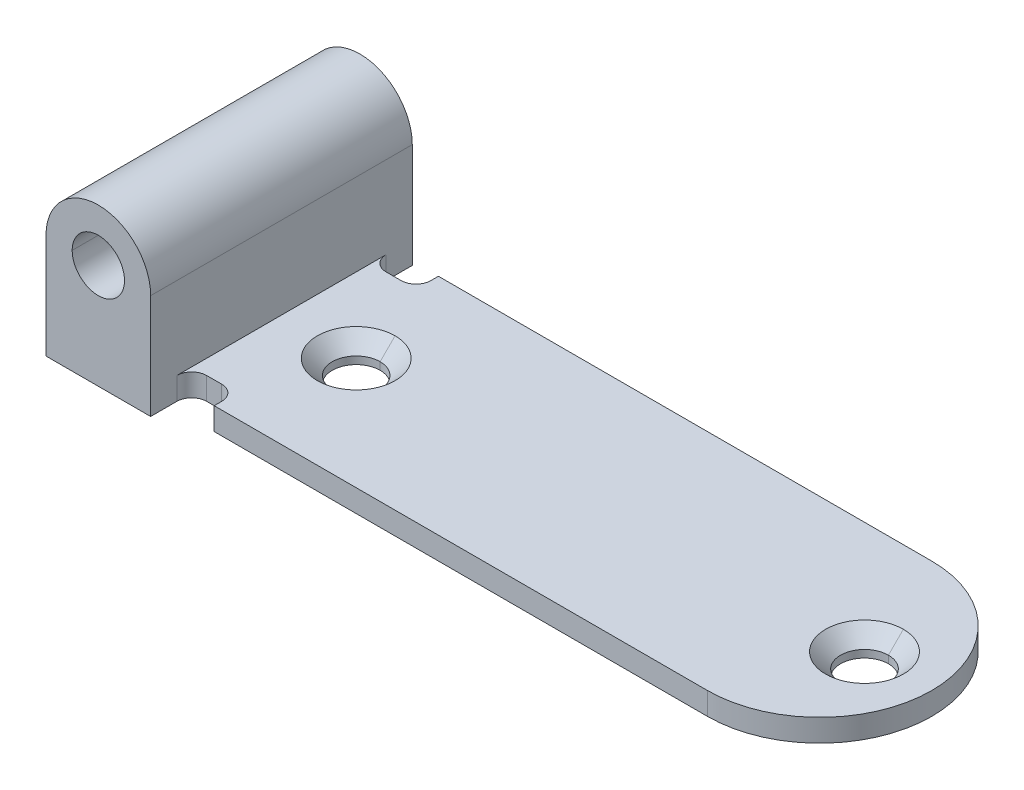
ISO-10303-21;
HEADER;
FILE_DESCRIPTION(('STEP AP214'),'2;1');
FILE_NAME('part.step','',(''),(''),'','','');
FILE_SCHEMA(('AUTOMOTIVE_DESIGN { 1 0 10303 214 1 1 1 1 }'));
ENDSEC;
DATA;
#1=APPLICATION_CONTEXT('core data for automotive mechanical design processes');
#2=APPLICATION_PROTOCOL_DEFINITION('international standard','automotive_design',2000,#1);
#3=PRODUCT_CONTEXT('',#1,'mechanical');
#4=PRODUCT('Part','Part','',(#3));
#5=PRODUCT_RELATED_PRODUCT_CATEGORY('part','',(#4));
#6=PRODUCT_DEFINITION_FORMATION('','',#4);
#7=PRODUCT_DEFINITION_CONTEXT('part definition',#1,'design');
#8=PRODUCT_DEFINITION('design','',#6,#7);
#9=PRODUCT_DEFINITION_SHAPE('','',#8);
#10=(LENGTH_UNIT() NAMED_UNIT(*) SI_UNIT(.MILLI.,.METRE.));
#11=(NAMED_UNIT(*) PLANE_ANGLE_UNIT() SI_UNIT($,.RADIAN.));
#12=(NAMED_UNIT(*) SI_UNIT($,.STERADIAN.) SOLID_ANGLE_UNIT());
#13=UNCERTAINTY_MEASURE_WITH_UNIT(LENGTH_MEASURE(1.E-05),#10,'distance_accuracy_value','');
#14=(GEOMETRIC_REPRESENTATION_CONTEXT(3) GLOBAL_UNCERTAINTY_ASSIGNED_CONTEXT((#13)) GLOBAL_UNIT_ASSIGNED_CONTEXT((#10,
#11,#12)) REPRESENTATION_CONTEXT('',''));
#15=CARTESIAN_POINT('',(0.,0.,0.));
#16=DIRECTION('',(0.,0.,1.));
#17=DIRECTION('',(1.,0.,0.));
#18=AXIS2_PLACEMENT_3D('',#15,#16,#17);
#19=CARTESIAN_POINT('',(51.,1.5,8.75));
#20=DIRECTION('',(0.,-1.,0.));
#21=DIRECTION('',(0.,0.,-1.));
#22=AXIS2_PLACEMENT_3D('',#19,#20,#21);
#23=PLANE('',#22);
#24=CARTESIAN_POINT('',(46.,1.5,0.));
#25=DIRECTION('',(0.,-1.,0.));
#26=DIRECTION('',(0.,0.,-1.));
#27=AXIS2_PLACEMENT_3D('',#24,#25,#26);
#28=CIRCLE('',#27,2.6);
#29=CARTESIAN_POINT('',(46.,1.5,-2.6));
#30=VERTEX_POINT('',#29);
#31=CARTESIAN_POINT('',(46.,1.5,2.6));
#32=VERTEX_POINT('',#31);
#33=EDGE_CURVE('E11',#30,#32,#28,.T.);
#34=ORIENTED_EDGE('',*,*,#33,.T.);
#35=CARTESIAN_POINT('',(46.,1.5,0.));
#36=DIRECTION('',(0.,-1.,0.));
#37=DIRECTION('',(0.,0.,-1.));
#38=AXIS2_PLACEMENT_3D('',#35,#36,#37);
#39=CIRCLE('',#38,2.6);
#40=EDGE_CURVE('E26',#32,#30,#39,.T.);
#41=ORIENTED_EDGE('',*,*,#40,.T.);
#42=EDGE_LOOP('',(#34,#41));
#43=FACE_BOUND('',#42,.T.);
#44=CARTESIAN_POINT('',(12.,1.5,0.));
#45=DIRECTION('',(0.,-1.,0.));
#46=DIRECTION('',(0.,0.,-1.));
#47=AXIS2_PLACEMENT_3D('',#44,#45,#46);
#48=CIRCLE('',#47,2.6);
#49=CARTESIAN_POINT('',(12.,1.5,-2.6));
#50=VERTEX_POINT('',#49);
#51=CARTESIAN_POINT('',(12.,1.5,2.6));
#52=VERTEX_POINT('',#51);
#53=EDGE_CURVE('E639',#50,#52,#48,.T.);
#54=ORIENTED_EDGE('',*,*,#53,.T.);
#55=CARTESIAN_POINT('',(12.,1.5,0.));
#56=DIRECTION('',(0.,-1.,0.));
#57=DIRECTION('',(0.,0.,-1.));
#58=AXIS2_PLACEMENT_3D('',#55,#56,#57);
#59=CIRCLE('',#58,2.6);
#60=EDGE_CURVE('E634',#52,#50,#59,.T.);
#61=ORIENTED_EDGE('',*,*,#60,.T.);
#62=EDGE_LOOP('',(#54,#61));
#63=FACE_BOUND('',#62,.T.);
#64=CARTESIAN_POINT('',(8.00000000000016,1.5,-7.00000000000016));
#65=DIRECTION('',(0.,1.,0.));
#66=DIRECTION('',(0.,0.,-1.));
#67=AXIS2_PLACEMENT_3D('',#64,#65,#66);
#68=CIRCLE('',#67,1.00000000000016);
#69=CARTESIAN_POINT('',(7.,1.5,-7.));
#70=VERTEX_POINT('',#69);
#71=CARTESIAN_POINT('',(8.,1.5,-6.));
#72=VERTEX_POINT('',#71);
#73=EDGE_CURVE('E628',#70,#72,#68,.T.);
#74=ORIENTED_EDGE('',*,*,#73,.F.);
#75=DIRECTION('',(0.,0.,-1.));
#76=VECTOR('',#75,1.);
#77=CARTESIAN_POINT('',(7.,1.5,8.75));
#78=LINE('',#77,#76);
#79=CARTESIAN_POINT('',(7.,1.5,7.));
#80=VERTEX_POINT('',#79);
#81=EDGE_CURVE('E622',#80,#70,#78,.T.);
#82=ORIENTED_EDGE('',*,*,#81,.F.);
#83=CARTESIAN_POINT('',(8.00000000000016,1.5,7.00000000000016));
#84=DIRECTION('',(0.,1.,0.));
#85=DIRECTION('',(0.,0.,-1.));
#86=AXIS2_PLACEMENT_3D('',#83,#84,#85);
#87=CIRCLE('',#86,1.00000000000016);
#88=CARTESIAN_POINT('',(8.,1.5,6.));
#89=VERTEX_POINT('',#88);
#90=EDGE_CURVE('E616',#89,#80,#87,.T.);
#91=ORIENTED_EDGE('',*,*,#90,.F.);
#92=DIRECTION('',(1.,0.,0.));
#93=VECTOR('',#92,1.);
#94=CARTESIAN_POINT('',(51.,1.5,6.));
#95=LINE('',#94,#93);
#96=CARTESIAN_POINT('',(9.,1.5,6.));
#97=VERTEX_POINT('',#96);
#98=EDGE_CURVE('E611',#89,#97,#95,.T.);
#99=ORIENTED_EDGE('',*,*,#98,.T.);
#100=CARTESIAN_POINT('',(9.,1.5,7.));
#101=DIRECTION('',(0.,1.,0.));
#102=DIRECTION('',(0.,0.,-1.));
#103=AXIS2_PLACEMENT_3D('',#100,#101,#102);
#104=CIRCLE('',#103,1.);
#105=CARTESIAN_POINT('',(10.,1.5,7.));
#106=VERTEX_POINT('',#105);
#107=EDGE_CURVE('E605',#106,#97,#104,.T.);
#108=ORIENTED_EDGE('',*,*,#107,.F.);
#109=DIRECTION('',(0.,0.,1.));
#110=VECTOR('',#109,1.);
#111=CARTESIAN_POINT('',(10.,1.5,8.75));
#112=LINE('',#111,#110);
#113=CARTESIAN_POINT('',(10.,1.5,7.5));
#114=VERTEX_POINT('',#113);
#115=EDGE_CURVE('E600',#106,#114,#112,.T.);
#116=ORIENTED_EDGE('',*,*,#115,.T.);
#117=DIRECTION('',(1.,0.,0.));
#118=VECTOR('',#117,1.);
#119=CARTESIAN_POINT('',(51.,1.5,7.5));
#120=LINE('',#119,#118);
#121=CARTESIAN_POINT('',(43.,1.5,7.5));
#122=VERTEX_POINT('',#121);
#123=EDGE_CURVE('E595',#114,#122,#120,.T.);
#124=ORIENTED_EDGE('',*,*,#123,.T.);
#125=CARTESIAN_POINT('',(43.,1.5,0.));
#126=DIRECTION('',(0.,1.,0.));
#127=DIRECTION('',(0.,0.,-1.));
#128=AXIS2_PLACEMENT_3D('',#125,#126,#127);
#129=CIRCLE('',#128,7.5);
#130=CARTESIAN_POINT('',(43.,1.5,-7.5));
#131=VERTEX_POINT('',#130);
#132=EDGE_CURVE('E590',#122,#131,#129,.T.);
#133=ORIENTED_EDGE('',*,*,#132,.T.);
#134=DIRECTION('',(-1.,0.,0.));
#135=VECTOR('',#134,1.);
#136=CARTESIAN_POINT('',(51.,1.5,-7.5));
#137=LINE('',#136,#135);
#138=CARTESIAN_POINT('',(10.,1.5,-7.5));
#139=VERTEX_POINT('',#138);
#140=EDGE_CURVE('E585',#131,#139,#137,.T.);
#141=ORIENTED_EDGE('',*,*,#140,.T.);
#142=DIRECTION('',(0.,0.,1.));
#143=VECTOR('',#142,1.);
#144=CARTESIAN_POINT('',(10.,1.5,8.75));
#145=LINE('',#144,#143);
#146=CARTESIAN_POINT('',(10.,1.5,-7.));
#147=VERTEX_POINT('',#146);
#148=EDGE_CURVE('E580',#139,#147,#145,.T.);
#149=ORIENTED_EDGE('',*,*,#148,.T.);
#150=CARTESIAN_POINT('',(9.,1.5,-7.));
#151=DIRECTION('',(0.,1.,0.));
#152=DIRECTION('',(0.,0.,-1.));
#153=AXIS2_PLACEMENT_3D('',#150,#151,#152);
#154=CIRCLE('',#153,1.);
#155=CARTESIAN_POINT('',(9.,1.5,-6.));
#156=VERTEX_POINT('',#155);
#157=EDGE_CURVE('E574',#156,#147,#154,.T.);
#158=ORIENTED_EDGE('',*,*,#157,.F.);
#159=DIRECTION('',(-1.,0.,0.));
#160=VECTOR('',#159,1.);
#161=CARTESIAN_POINT('',(51.,1.5,-6.));
#162=LINE('',#161,#160);
#163=EDGE_CURVE('E569',#156,#72,#162,.T.);
#164=ORIENTED_EDGE('',*,*,#163,.T.);
#165=EDGE_LOOP('',(#74,#82,#91,#99,#108,#116,#124,#133,#141,#149,#158,#164));
#166=FACE_BOUND('',#165,.T.);
#167=ADVANCED_FACE('F17',(#43,#63,#166),#23,.F.);
#168=CARTESIAN_POINT('',(9.,18.,-6.));
#169=DIRECTION('',(0.,0.,1.));
#170=DIRECTION('',(1.,0.,0.));
#171=AXIS2_PLACEMENT_3D('',#168,#169,#170);
#172=PLANE('',#171);
#173=DIRECTION('',(0.,-1.,0.));
#174=VECTOR('',#173,1.);
#175=CARTESIAN_POINT('',(9.,18.,-6.));
#176=LINE('',#175,#174);
#177=CARTESIAN_POINT('',(9.,0.,-6.));
#178=VERTEX_POINT('',#177);
#179=EDGE_CURVE('E564',#156,#178,#176,.T.);
#180=ORIENTED_EDGE('',*,*,#179,.T.);
#181=DIRECTION('',(-1.,0.,0.));
#182=VECTOR('',#181,1.);
#183=CARTESIAN_POINT('',(9.,0.,-6.));
#184=LINE('',#183,#182);
#185=CARTESIAN_POINT('',(8.,0.,-6.));
#186=VERTEX_POINT('',#185);
#187=EDGE_CURVE('E559',#178,#186,#184,.T.);
#188=ORIENTED_EDGE('',*,*,#187,.T.);
#189=DIRECTION('',(0.,-1.,0.));
#190=VECTOR('',#189,1.);
#191=CARTESIAN_POINT('',(8.,18.,-6.));
#192=LINE('',#191,#190);
#193=EDGE_CURVE('E553',#72,#186,#192,.T.);
#194=ORIENTED_EDGE('',*,*,#193,.F.);
#195=ORIENTED_EDGE('',*,*,#163,.F.);
#196=EDGE_LOOP('',(#180,#188,#194,#195));
#197=FACE_BOUND('',#196,.T.);
#198=ADVANCED_FACE('F694',(#197),#172,.F.);
#199=CARTESIAN_POINT('',(8.00000000000016,18.,-7.00000000000016));
#200=DIRECTION('',(0.,-1.,0.));
#201=DIRECTION('',(0.707106781186818,0.,-0.707106781186277));
#202=AXIS2_PLACEMENT_3D('',#199,#200,#201);
#203=CYLINDRICAL_SURFACE('',#202,1.00000000000016);
#204=ORIENTED_EDGE('',*,*,#73,.T.);
#205=ORIENTED_EDGE('',*,*,#193,.T.);
#206=CARTESIAN_POINT('',(8.00000000000016,0.,-7.00000000000016));
#207=DIRECTION('',(0.,1.,0.));
#208=DIRECTION('',(1.,0.,0.));
#209=AXIS2_PLACEMENT_3D('',#206,#207,#208);
#210=CIRCLE('',#209,1.00000000000016);
#211=CARTESIAN_POINT('',(7.,0.,-7.));
#212=VERTEX_POINT('',#211);
#213=EDGE_CURVE('E547',#212,#186,#210,.T.);
#214=ORIENTED_EDGE('',*,*,#213,.F.);
#215=DIRECTION('',(0.,-1.,0.));
#216=VECTOR('',#215,1.);
#217=CARTESIAN_POINT('',(7.,18.,-7.));
#218=LINE('',#217,#216);
#219=EDGE_CURVE('E541',#70,#212,#218,.T.);
#220=ORIENTED_EDGE('',*,*,#219,.F.);
#221=EDGE_LOOP('',(#204,#205,#214,#220));
#222=FACE_BOUND('',#221,.T.);
#223=ADVANCED_FACE('F689',(#222),#203,.F.);
#224=CARTESIAN_POINT('',(7.,1.5,8.75));
#225=DIRECTION('',(-1.,0.,0.));
#226=DIRECTION('',(0.,0.,1.));
#227=AXIS2_PLACEMENT_3D('',#224,#225,#226);
#228=PLANE('',#227);
#229=DIRECTION('',(0.,1.,0.));
#230=VECTOR('',#229,1.);
#231=CARTESIAN_POINT('',(7.,1.5,8.75));
#232=LINE('',#231,#230);
#233=CARTESIAN_POINT('',(7.,0.,8.75));
#234=VERTEX_POINT('',#233);
#235=CARTESIAN_POINT('',(7.,7.,8.75));
#236=VERTEX_POINT('',#235);
#237=EDGE_CURVE('E535',#234,#236,#232,.T.);
#238=ORIENTED_EDGE('',*,*,#237,.F.);
#239=DIRECTION('',(0.,0.,-1.));
#240=VECTOR('',#239,1.);
#241=CARTESIAN_POINT('',(7.,0.,8.75));
#242=LINE('',#241,#240);
#243=CARTESIAN_POINT('',(7.,0.,7.));
#244=VERTEX_POINT('',#243);
#245=EDGE_CURVE('E530',#234,#244,#242,.T.);
#246=ORIENTED_EDGE('',*,*,#245,.T.);
#247=DIRECTION('',(0.,-1.,0.));
#248=VECTOR('',#247,1.);
#249=CARTESIAN_POINT('',(7.,18.,7.));
#250=LINE('',#249,#248);
#251=EDGE_CURVE('E524',#80,#244,#250,.T.);
#252=ORIENTED_EDGE('',*,*,#251,.F.);
#253=ORIENTED_EDGE('',*,*,#81,.T.);
#254=ORIENTED_EDGE('',*,*,#219,.T.);
#255=DIRECTION('',(0.,0.,-1.));
#256=VECTOR('',#255,1.);
#257=CARTESIAN_POINT('',(7.,0.,-7.));
#258=LINE('',#257,#256);
#259=CARTESIAN_POINT('',(7.,0.,-8.75));
#260=VERTEX_POINT('',#259);
#261=EDGE_CURVE('E519',#212,#260,#258,.T.);
#262=ORIENTED_EDGE('',*,*,#261,.T.);
#263=DIRECTION('',(0.,1.,0.));
#264=VECTOR('',#263,1.);
#265=CARTESIAN_POINT('',(7.,1.5,-8.75));
#266=LINE('',#265,#264);
#267=CARTESIAN_POINT('',(7.,7.,-8.75));
#268=VERTEX_POINT('',#267);
#269=EDGE_CURVE('E514',#260,#268,#266,.T.);
#270=ORIENTED_EDGE('',*,*,#269,.T.);
#271=DIRECTION('',(0.,0.,-1.));
#272=VECTOR('',#271,1.);
#273=CARTESIAN_POINT('',(7.,7.,8.75));
#274=LINE('',#273,#272);
#275=EDGE_CURVE('E508',#236,#268,#274,.T.);
#276=ORIENTED_EDGE('',*,*,#275,.F.);
#277=EDGE_LOOP('',(#238,#246,#252,#253,#254,#262,#270,#276));
#278=FACE_BOUND('',#277,.T.);
#279=ADVANCED_FACE('F684',(#278),#228,.F.);
#280=CARTESIAN_POINT('',(3.5,7.,8.75));
#281=DIRECTION('',(0.,0.,-1.));
#282=DIRECTION('',(0.,-1.,0.));
#283=AXIS2_PLACEMENT_3D('',#280,#281,#282);
#284=CYLINDRICAL_SURFACE('',#283,3.5);
#285=CARTESIAN_POINT('',(3.5,7.,-8.75));
#286=DIRECTION('',(0.,0.,1.));
#287=DIRECTION('',(1.,0.,0.));
#288=AXIS2_PLACEMENT_3D('',#285,#286,#287);
#289=CIRCLE('',#288,3.5);
#290=CARTESIAN_POINT('',(0.,7.,-8.75));
#291=VERTEX_POINT('',#290);
#292=EDGE_CURVE('E503',#268,#291,#289,.T.);
#293=ORIENTED_EDGE('',*,*,#292,.T.);
#294=DIRECTION('',(0.,0.,-1.));
#295=VECTOR('',#294,1.);
#296=CARTESIAN_POINT('',(0.,7.,8.75));
#297=LINE('',#296,#295);
#298=CARTESIAN_POINT('',(0.,7.,8.75));
#299=VERTEX_POINT('',#298);
#300=EDGE_CURVE('E497',#299,#291,#297,.T.);
#301=ORIENTED_EDGE('',*,*,#300,.F.);
#302=CARTESIAN_POINT('',(3.5,7.,8.75));
#303=DIRECTION('',(0.,0.,1.));
#304=DIRECTION('',(1.,0.,0.));
#305=AXIS2_PLACEMENT_3D('',#302,#303,#304);
#306=CIRCLE('',#305,3.5);
#307=EDGE_CURVE('E491',#236,#299,#306,.T.);
#308=ORIENTED_EDGE('',*,*,#307,.F.);
#309=ORIENTED_EDGE('',*,*,#275,.T.);
#310=EDGE_LOOP('',(#293,#301,#308,#309));
#311=FACE_BOUND('',#310,.T.);
#312=ADVANCED_FACE('F737',(#311),#284,.T.);
#313=CARTESIAN_POINT('',(3.5,7.,8.75));
#314=DIRECTION('',(0.,0.,1.));
#315=DIRECTION('',(1.,0.,0.));
#316=AXIS2_PLACEMENT_3D('',#313,#314,#315);
#317=PLANE('',#316);
#318=DIRECTION('',(1.,0.,0.));
#319=VECTOR('',#318,1.);
#320=CARTESIAN_POINT('',(0.,0.,8.75));
#321=LINE('',#320,#319);
#322=CARTESIAN_POINT('',(0.,0.,8.75));
#323=VERTEX_POINT('',#322);
#324=EDGE_CURVE('E485',#323,#234,#321,.T.);
#325=ORIENTED_EDGE('',*,*,#324,.T.);
#326=ORIENTED_EDGE('',*,*,#237,.T.);
#327=ORIENTED_EDGE('',*,*,#307,.T.);
#328=DIRECTION('',(0.,-1.,0.));
#329=VECTOR('',#328,1.);
#330=CARTESIAN_POINT('',(0.,7.,8.75));
#331=LINE('',#330,#329);
#332=EDGE_CURVE('E480',#299,#323,#331,.T.);
#333=ORIENTED_EDGE('',*,*,#332,.T.);
#334=EDGE_LOOP('',(#325,#326,#327,#333));
#335=FACE_BOUND('',#334,.T.);
#336=CARTESIAN_POINT('',(3.5,7.,8.75));
#337=DIRECTION('',(0.,0.,1.));
#338=DIRECTION('',(1.,0.,0.));
#339=AXIS2_PLACEMENT_3D('',#336,#337,#338);
#340=CIRCLE('',#339,1.75);
#341=CARTESIAN_POINT('',(1.75,7.,8.75));
#342=VERTEX_POINT('',#341);
#343=CARTESIAN_POINT('',(5.25,7.,8.75));
#344=VERTEX_POINT('',#343);
#345=EDGE_CURVE('E474',#342,#344,#340,.T.);
#346=ORIENTED_EDGE('',*,*,#345,.F.);
#347=CARTESIAN_POINT('',(3.5,7.,8.75));
#348=DIRECTION('',(0.,0.,1.));
#349=DIRECTION('',(1.,0.,0.));
#350=AXIS2_PLACEMENT_3D('',#347,#348,#349);
#351=CIRCLE('',#350,1.75);
#352=EDGE_CURVE('E468',#344,#342,#351,.T.);
#353=ORIENTED_EDGE('',*,*,#352,.F.);
#354=EDGE_LOOP('',(#346,#353));
#355=FACE_BOUND('',#354,.T.);
#356=ADVANCED_FACE('F732',(#335,#355),#317,.T.);
#357=CARTESIAN_POINT('',(3.5,7.,8.75));
#358=DIRECTION('',(0.,0.,-1.));
#359=DIRECTION('',(0.,-1.,0.));
#360=AXIS2_PLACEMENT_3D('',#357,#358,#359);
#361=CYLINDRICAL_SURFACE('',#360,1.75);
#362=DIRECTION('',(0.,0.,-1.));
#363=VECTOR('',#362,1.);
#364=CARTESIAN_POINT('',(5.25,7.,8.75));
#365=LINE('',#364,#363);
#366=CARTESIAN_POINT('',(5.25,7.,-8.75));
#367=VERTEX_POINT('',#366);
#368=EDGE_CURVE('E462',#344,#367,#365,.T.);
#369=ORIENTED_EDGE('',*,*,#368,.F.);
#370=ORIENTED_EDGE('',*,*,#352,.T.);
#371=DIRECTION('',(0.,0.,-1.));
#372=VECTOR('',#371,1.);
#373=CARTESIAN_POINT('',(1.75,7.,8.75));
#374=LINE('',#373,#372);
#375=CARTESIAN_POINT('',(1.75,7.,-8.75));
#376=VERTEX_POINT('',#375);
#377=EDGE_CURVE('E457',#342,#376,#374,.T.);
#378=ORIENTED_EDGE('',*,*,#377,.T.);
#379=CARTESIAN_POINT('',(3.5,7.,-8.75));
#380=DIRECTION('',(0.,0.,1.));
#381=DIRECTION('',(1.,0.,0.));
#382=AXIS2_PLACEMENT_3D('',#379,#380,#381);
#383=CIRCLE('',#382,1.75);
#384=EDGE_CURVE('E451',#367,#376,#383,.T.);
#385=ORIENTED_EDGE('',*,*,#384,.F.);
#386=EDGE_LOOP('',(#369,#370,#378,#385));
#387=FACE_BOUND('',#386,.T.);
#388=ADVANCED_FACE('F745',(#387),#361,.F.);
#389=CARTESIAN_POINT('',(3.5,7.,-8.75));
#390=DIRECTION('',(0.,0.,1.));
#391=DIRECTION('',(1.,0.,0.));
#392=AXIS2_PLACEMENT_3D('',#389,#390,#391);
#393=PLANE('',#392);
#394=ORIENTED_EDGE('',*,*,#384,.T.);
#395=CARTESIAN_POINT('',(3.5,7.,-8.75));
#396=DIRECTION('',(0.,0.,1.));
#397=DIRECTION('',(1.,0.,0.));
#398=AXIS2_PLACEMENT_3D('',#395,#396,#397);
#399=CIRCLE('',#398,1.75);
#400=EDGE_CURVE('E445',#376,#367,#399,.T.);
#401=ORIENTED_EDGE('',*,*,#400,.T.);
#402=EDGE_LOOP('',(#394,#401));
#403=FACE_BOUND('',#402,.T.);
#404=ORIENTED_EDGE('',*,*,#269,.F.);
#405=DIRECTION('',(1.,0.,0.));
#406=VECTOR('',#405,1.);
#407=CARTESIAN_POINT('',(0.,0.,-8.75));
#408=LINE('',#407,#406);
#409=CARTESIAN_POINT('',(0.,0.,-8.75));
#410=VERTEX_POINT('',#409);
#411=EDGE_CURVE('E439',#410,#260,#408,.T.);
#412=ORIENTED_EDGE('',*,*,#411,.F.);
#413=DIRECTION('',(0.,-1.,0.));
#414=VECTOR('',#413,1.);
#415=CARTESIAN_POINT('',(0.,7.,-8.75));
#416=LINE('',#415,#414);
#417=EDGE_CURVE('E433',#291,#410,#416,.T.);
#418=ORIENTED_EDGE('',*,*,#417,.F.);
#419=ORIENTED_EDGE('',*,*,#292,.F.);
#420=EDGE_LOOP('',(#404,#412,#418,#419));
#421=FACE_BOUND('',#420,.T.);
#422=ADVANCED_FACE('F682',(#403,#421),#393,.F.);
#423=CARTESIAN_POINT('',(0.,7.,8.75));
#424=DIRECTION('',(1.,0.,0.));
#425=DIRECTION('',(0.,0.,-1.));
#426=AXIS2_PLACEMENT_3D('',#423,#424,#425);
#427=PLANE('',#426);
#428=ORIENTED_EDGE('',*,*,#417,.T.);
#429=DIRECTION('',(0.,0.,-1.));
#430=VECTOR('',#429,1.);
#431=CARTESIAN_POINT('',(0.,0.,8.75));
#432=LINE('',#431,#430);
#433=EDGE_CURVE('E427',#323,#410,#432,.T.);
#434=ORIENTED_EDGE('',*,*,#433,.F.);
#435=ORIENTED_EDGE('',*,*,#332,.F.);
#436=ORIENTED_EDGE('',*,*,#300,.T.);
#437=EDGE_LOOP('',(#428,#434,#435,#436));
#438=FACE_BOUND('',#437,.T.);
#439=ADVANCED_FACE('F672',(#438),#427,.F.);
#440=CARTESIAN_POINT('',(0.,0.,8.75));
#441=DIRECTION('',(0.,1.,0.));
#442=DIRECTION('',(0.,0.,1.));
#443=AXIS2_PLACEMENT_3D('',#440,#441,#442);
#444=PLANE('',#443);
#445=CARTESIAN_POINT('',(46.,0.,0.));
#446=DIRECTION('',(0.,-1.,0.));
#447=DIRECTION('',(0.,0.,-1.));
#448=AXIS2_PLACEMENT_3D('',#445,#446,#447);
#449=CIRCLE('',#448,1.6);
#450=CARTESIAN_POINT('',(46.,0.,1.6));
#451=VERTEX_POINT('',#450);
#452=CARTESIAN_POINT('',(46.,0.,-1.6));
#453=VERTEX_POINT('',#452);
#454=EDGE_CURVE('E242',#451,#453,#449,.T.);
#455=ORIENTED_EDGE('',*,*,#454,.F.);
#456=CARTESIAN_POINT('',(46.,0.,0.));
#457=DIRECTION('',(0.,-1.,0.));
#458=DIRECTION('',(0.,0.,-1.));
#459=AXIS2_PLACEMENT_3D('',#456,#457,#458);
#460=CIRCLE('',#459,1.6);
#461=EDGE_CURVE('E418',#453,#451,#460,.T.);
#462=ORIENTED_EDGE('',*,*,#461,.F.);
#463=EDGE_LOOP('',(#455,#462));
#464=FACE_BOUND('',#463,.T.);
#465=CARTESIAN_POINT('',(12.,0.,0.));
#466=DIRECTION('',(0.,-1.,0.));
#467=DIRECTION('',(0.,0.,-1.));
#468=AXIS2_PLACEMENT_3D('',#465,#466,#467);
#469=CIRCLE('',#468,1.6);
#470=CARTESIAN_POINT('',(12.,0.,1.6));
#471=VERTEX_POINT('',#470);
#472=CARTESIAN_POINT('',(12.,0.,-1.6));
#473=VERTEX_POINT('',#472);
#474=EDGE_CURVE('E412',#471,#473,#469,.T.);
#475=ORIENTED_EDGE('',*,*,#474,.F.);
#476=CARTESIAN_POINT('',(12.,0.,0.));
#477=DIRECTION('',(0.,-1.,0.));
#478=DIRECTION('',(0.,0.,-1.));
#479=AXIS2_PLACEMENT_3D('',#476,#477,#478);
#480=CIRCLE('',#479,1.6);
#481=EDGE_CURVE('E406',#473,#471,#480,.T.);
#482=ORIENTED_EDGE('',*,*,#481,.F.);
#483=EDGE_LOOP('',(#475,#482));
#484=FACE_BOUND('',#483,.T.);
#485=ORIENTED_EDGE('',*,*,#411,.T.);
#486=ORIENTED_EDGE('',*,*,#261,.F.);
#487=ORIENTED_EDGE('',*,*,#213,.T.);
#488=ORIENTED_EDGE('',*,*,#187,.F.);
#489=CARTESIAN_POINT('',(9.,0.,-7.));
#490=DIRECTION('',(0.,1.,0.));
#491=DIRECTION('',(1.,0.,0.));
#492=AXIS2_PLACEMENT_3D('',#489,#490,#491);
#493=CIRCLE('',#492,1.);
#494=CARTESIAN_POINT('',(10.,0.,-7.));
#495=VERTEX_POINT('',#494);
#496=EDGE_CURVE('E401',#178,#495,#493,.T.);
#497=ORIENTED_EDGE('',*,*,#496,.T.);
#498=DIRECTION('',(0.,0.,1.));
#499=VECTOR('',#498,1.);
#500=CARTESIAN_POINT('',(10.,0.,-7.5));
#501=LINE('',#500,#499);
#502=CARTESIAN_POINT('',(10.,0.,-7.5));
#503=VERTEX_POINT('',#502);
#504=EDGE_CURVE('E395',#503,#495,#501,.T.);
#505=ORIENTED_EDGE('',*,*,#504,.F.);
#506=DIRECTION('',(-1.,0.,0.));
#507=VECTOR('',#506,1.);
#508=CARTESIAN_POINT('',(43.,0.,-7.5));
#509=LINE('',#508,#507);
#510=CARTESIAN_POINT('',(43.,0.,-7.5));
#511=VERTEX_POINT('',#510);
#512=EDGE_CURVE('E389',#511,#503,#509,.T.);
#513=ORIENTED_EDGE('',*,*,#512,.F.);
#514=CARTESIAN_POINT('',(43.,0.,0.));
#515=DIRECTION('',(0.,1.,0.));
#516=DIRECTION('',(1.,0.,0.));
#517=AXIS2_PLACEMENT_3D('',#514,#515,#516);
#518=CIRCLE('',#517,7.5);
#519=CARTESIAN_POINT('',(43.,0.,7.5));
#520=VERTEX_POINT('',#519);
#521=EDGE_CURVE('E383',#520,#511,#518,.T.);
#522=ORIENTED_EDGE('',*,*,#521,.F.);
#523=DIRECTION('',(1.,0.,0.));
#524=VECTOR('',#523,1.);
#525=CARTESIAN_POINT('',(10.,0.,7.5));
#526=LINE('',#525,#524);
#527=CARTESIAN_POINT('',(10.,0.,7.5));
#528=VERTEX_POINT('',#527);
#529=EDGE_CURVE('E377',#528,#520,#526,.T.);
#530=ORIENTED_EDGE('',*,*,#529,.F.);
#531=DIRECTION('',(0.,0.,1.));
#532=VECTOR('',#531,1.);
#533=CARTESIAN_POINT('',(10.,0.,7.));
#534=LINE('',#533,#532);
#535=CARTESIAN_POINT('',(10.,0.,7.));
#536=VERTEX_POINT('',#535);
#537=EDGE_CURVE('E371',#536,#528,#534,.T.);
#538=ORIENTED_EDGE('',*,*,#537,.F.);
#539=CARTESIAN_POINT('',(9.,0.,7.));
#540=DIRECTION('',(0.,1.,0.));
#541=DIRECTION('',(1.,0.,0.));
#542=AXIS2_PLACEMENT_3D('',#539,#540,#541);
#543=CIRCLE('',#542,1.);
#544=CARTESIAN_POINT('',(9.,0.,6.));
#545=VERTEX_POINT('',#544);
#546=EDGE_CURVE('E366',#536,#545,#543,.T.);
#547=ORIENTED_EDGE('',*,*,#546,.T.);
#548=DIRECTION('',(1.,0.,0.));
#549=VECTOR('',#548,1.);
#550=CARTESIAN_POINT('',(8.,0.,6.));
#551=LINE('',#550,#549);
#552=CARTESIAN_POINT('',(8.,0.,6.));
#553=VERTEX_POINT('',#552);
#554=EDGE_CURVE('E360',#553,#545,#551,.T.);
#555=ORIENTED_EDGE('',*,*,#554,.F.);
#556=CARTESIAN_POINT('',(8.00000000000016,0.,7.00000000000016));
#557=DIRECTION('',(0.,1.,0.));
#558=DIRECTION('',(1.,0.,0.));
#559=AXIS2_PLACEMENT_3D('',#556,#557,#558);
#560=CIRCLE('',#559,1.00000000000016);
#561=EDGE_CURVE('E354',#553,#244,#560,.T.);
#562=ORIENTED_EDGE('',*,*,#561,.T.);
#563=ORIENTED_EDGE('',*,*,#245,.F.);
#564=ORIENTED_EDGE('',*,*,#324,.F.);
#565=ORIENTED_EDGE('',*,*,#433,.T.);
#566=EDGE_LOOP('',(#485,#486,#487,#488,#497,#505,#513,#522,#530,#538,#547,#555,#562,#563,#564,#565));
#567=FACE_BOUND('',#566,.T.);
#568=ADVANCED_FACE('F668',(#464,#484,#567),#444,.F.);
#569=CARTESIAN_POINT('',(8.00000000000016,18.,7.00000000000016));
#570=DIRECTION('',(0.,-1.,0.));
#571=DIRECTION('',(0.707106781186515,0.,0.70710678118658));
#572=AXIS2_PLACEMENT_3D('',#569,#570,#571);
#573=CYLINDRICAL_SURFACE('',#572,1.00000000000016);
#574=ORIENTED_EDGE('',*,*,#90,.T.);
#575=ORIENTED_EDGE('',*,*,#251,.T.);
#576=ORIENTED_EDGE('',*,*,#561,.F.);
#577=DIRECTION('',(0.,-1.,0.));
#578=VECTOR('',#577,1.);
#579=CARTESIAN_POINT('',(8.,18.,6.));
#580=LINE('',#579,#578);
#581=EDGE_CURVE('E348',#89,#553,#580,.T.);
#582=ORIENTED_EDGE('',*,*,#581,.F.);
#583=EDGE_LOOP('',(#574,#575,#576,#582));
#584=FACE_BOUND('',#583,.T.);
#585=ADVANCED_FACE('F671',(#584),#573,.F.);
#586=CARTESIAN_POINT('',(8.,18.,6.));
#587=DIRECTION('',(0.,0.,-1.));
#588=DIRECTION('',(-1.,0.,0.));
#589=AXIS2_PLACEMENT_3D('',#586,#587,#588);
#590=PLANE('',#589);
#591=ORIENTED_EDGE('',*,*,#581,.T.);
#592=ORIENTED_EDGE('',*,*,#554,.T.);
#593=DIRECTION('',(0.,-1.,0.));
#594=VECTOR('',#593,1.);
#595=CARTESIAN_POINT('',(9.,18.,6.));
#596=LINE('',#595,#594);
#597=EDGE_CURVE('E342',#97,#545,#596,.T.);
#598=ORIENTED_EDGE('',*,*,#597,.F.);
#599=ORIENTED_EDGE('',*,*,#98,.F.);
#600=EDGE_LOOP('',(#591,#592,#598,#599));
#601=FACE_BOUND('',#600,.T.);
#602=ADVANCED_FACE('F726',(#601),#590,.F.);
#603=CARTESIAN_POINT('',(9.,18.,7.));
#604=DIRECTION('',(0.,-1.,0.));
#605=DIRECTION('',(-0.707106781186548,0.,0.707106781186547));
#606=AXIS2_PLACEMENT_3D('',#603,#604,#605);
#607=CYLINDRICAL_SURFACE('',#606,1.);
#608=ORIENTED_EDGE('',*,*,#107,.T.);
#609=ORIENTED_EDGE('',*,*,#597,.T.);
#610=ORIENTED_EDGE('',*,*,#546,.F.);
#611=DIRECTION('',(0.,-1.,0.));
#612=VECTOR('',#611,1.);
#613=CARTESIAN_POINT('',(10.,18.,7.));
#614=LINE('',#613,#612);
#615=EDGE_CURVE('E336',#106,#536,#614,.T.);
#616=ORIENTED_EDGE('',*,*,#615,.F.);
#617=EDGE_LOOP('',(#608,#609,#610,#616));
#618=FACE_BOUND('',#617,.T.);
#619=ADVANCED_FACE('F722',(#618),#607,.F.);
#620=CARTESIAN_POINT('',(10.,18.,7.));
#621=DIRECTION('',(1.,0.,0.));
#622=DIRECTION('',(0.,0.,-1.));
#623=AXIS2_PLACEMENT_3D('',#620,#621,#622);
#624=PLANE('',#623);
#625=ORIENTED_EDGE('',*,*,#615,.T.);
#626=ORIENTED_EDGE('',*,*,#537,.T.);
#627=DIRECTION('',(0.,-1.,0.));
#628=VECTOR('',#627,1.);
#629=CARTESIAN_POINT('',(10.,18.,7.5));
#630=LINE('',#629,#628);
#631=EDGE_CURVE('E330',#114,#528,#630,.T.);
#632=ORIENTED_EDGE('',*,*,#631,.F.);
#633=ORIENTED_EDGE('',*,*,#115,.F.);
#634=EDGE_LOOP('',(#625,#626,#632,#633));
#635=FACE_BOUND('',#634,.T.);
#636=ADVANCED_FACE('F720',(#635),#624,.F.);
#637=CARTESIAN_POINT('',(10.,18.,7.5));
#638=DIRECTION('',(0.,0.,-1.));
#639=DIRECTION('',(-1.,0.,0.));
#640=AXIS2_PLACEMENT_3D('',#637,#638,#639);
#641=PLANE('',#640);
#642=ORIENTED_EDGE('',*,*,#631,.T.);
#643=ORIENTED_EDGE('',*,*,#529,.T.);
#644=DIRECTION('',(0.,-1.,0.));
#645=VECTOR('',#644,1.);
#646=CARTESIAN_POINT('',(43.,18.,7.5));
#647=LINE('',#646,#645);
#648=EDGE_CURVE('E324',#122,#520,#647,.T.);
#649=ORIENTED_EDGE('',*,*,#648,.F.);
#650=ORIENTED_EDGE('',*,*,#123,.F.);
#651=EDGE_LOOP('',(#642,#643,#649,#650));
#652=FACE_BOUND('',#651,.T.);
#653=ADVANCED_FACE('F714',(#652),#641,.F.);
#654=CARTESIAN_POINT('',(43.,18.,0.));
#655=DIRECTION('',(0.,-1.,0.));
#656=DIRECTION('',(-1.,0.,0.));
#657=AXIS2_PLACEMENT_3D('',#654,#655,#656);
#658=CYLINDRICAL_SURFACE('',#657,7.5);
#659=ORIENTED_EDGE('',*,*,#648,.T.);
#660=ORIENTED_EDGE('',*,*,#521,.T.);
#661=DIRECTION('',(0.,-1.,0.));
#662=VECTOR('',#661,1.);
#663=CARTESIAN_POINT('',(43.,18.,-7.5));
#664=LINE('',#663,#662);
#665=EDGE_CURVE('E319',#131,#511,#664,.T.);
#666=ORIENTED_EDGE('',*,*,#665,.F.);
#667=ORIENTED_EDGE('',*,*,#132,.F.);
#668=EDGE_LOOP('',(#659,#660,#666,#667));
#669=FACE_BOUND('',#668,.T.);
#670=ADVANCED_FACE('F710',(#669),#658,.T.);
#671=CARTESIAN_POINT('',(43.,18.,-7.5));
#672=DIRECTION('',(0.,0.,1.));
#673=DIRECTION('',(1.,0.,0.));
#674=AXIS2_PLACEMENT_3D('',#671,#672,#673);
#675=PLANE('',#674);
#676=ORIENTED_EDGE('',*,*,#665,.T.);
#677=ORIENTED_EDGE('',*,*,#512,.T.);
#678=DIRECTION('',(0.,-1.,0.));
#679=VECTOR('',#678,1.);
#680=CARTESIAN_POINT('',(10.,18.,-7.5));
#681=LINE('',#680,#679);
#682=EDGE_CURVE('E313',#139,#503,#681,.T.);
#683=ORIENTED_EDGE('',*,*,#682,.F.);
#684=ORIENTED_EDGE('',*,*,#140,.F.);
#685=EDGE_LOOP('',(#676,#677,#683,#684));
#686=FACE_BOUND('',#685,.T.);
#687=ADVANCED_FACE('F707',(#686),#675,.F.);
#688=CARTESIAN_POINT('',(10.,18.,-7.5));
#689=DIRECTION('',(1.,0.,0.));
#690=DIRECTION('',(0.,0.,-1.));
#691=AXIS2_PLACEMENT_3D('',#688,#689,#690);
#692=PLANE('',#691);
#693=ORIENTED_EDGE('',*,*,#682,.T.);
#694=ORIENTED_EDGE('',*,*,#504,.T.);
#695=DIRECTION('',(0.,-1.,0.));
#696=VECTOR('',#695,1.);
#697=CARTESIAN_POINT('',(10.,18.,-7.));
#698=LINE('',#697,#696);
#699=EDGE_CURVE('E307',#147,#495,#698,.T.);
#700=ORIENTED_EDGE('',*,*,#699,.F.);
#701=ORIENTED_EDGE('',*,*,#148,.F.);
#702=EDGE_LOOP('',(#693,#694,#700,#701));
#703=FACE_BOUND('',#702,.T.);
#704=ADVANCED_FACE('F702',(#703),#692,.F.);
#705=CARTESIAN_POINT('',(9.,18.,-7.));
#706=DIRECTION('',(0.,-1.,0.));
#707=DIRECTION('',(-0.707106781186548,0.,-0.707106781186548));
#708=AXIS2_PLACEMENT_3D('',#705,#706,#707);
#709=CYLINDRICAL_SURFACE('',#708,1.);
#710=ORIENTED_EDGE('',*,*,#157,.T.);
#711=ORIENTED_EDGE('',*,*,#699,.T.);
#712=ORIENTED_EDGE('',*,*,#496,.F.);
#713=ORIENTED_EDGE('',*,*,#179,.F.);
#714=EDGE_LOOP('',(#710,#711,#712,#713));
#715=FACE_BOUND('',#714,.T.);
#716=ADVANCED_FACE('F698',(#715),#709,.F.);
#717=CARTESIAN_POINT('',(12.,0.,0.));
#718=DIRECTION('',(0.,-1.,0.));
#719=DIRECTION('',(-1.,0.,0.));
#720=AXIS2_PLACEMENT_3D('',#717,#718,#719);
#721=CYLINDRICAL_SURFACE('',#720,1.6);
#722=DIRECTION('',(0.,-1.,0.));
#723=VECTOR('',#722,1.);
#724=CARTESIAN_POINT('',(12.,0.5,1.6));
#725=LINE('',#724,#723);
#726=CARTESIAN_POINT('',(12.,0.5,1.6));
#727=VERTEX_POINT('',#726);
#728=EDGE_CURVE('E301',#727,#471,#725,.T.);
#729=ORIENTED_EDGE('',*,*,#728,.F.);
#730=CARTESIAN_POINT('',(12.,0.5,0.));
#731=DIRECTION('',(0.,-1.,0.));
#732=DIRECTION('',(0.,0.,-1.));
#733=AXIS2_PLACEMENT_3D('',#730,#731,#732);
#734=CIRCLE('',#733,1.6);
#735=CARTESIAN_POINT('',(12.,0.5,-1.6));
#736=VERTEX_POINT('',#735);
#737=EDGE_CURVE('E295',#736,#727,#734,.T.);
#738=ORIENTED_EDGE('',*,*,#737,.F.);
#739=DIRECTION('',(0.,-1.,0.));
#740=VECTOR('',#739,1.);
#741=CARTESIAN_POINT('',(12.,0.5,-1.6));
#742=LINE('',#741,#740);
#743=EDGE_CURVE('E289',#736,#473,#742,.T.);
#744=ORIENTED_EDGE('',*,*,#743,.T.);
#745=ORIENTED_EDGE('',*,*,#481,.T.);
#746=EDGE_LOOP('',(#729,#738,#744,#745));
#747=FACE_BOUND('',#746,.T.);
#748=ADVANCED_FACE('F666',(#747),#721,.F.);
#749=CARTESIAN_POINT('',(12.,0.,0.));
#750=DIRECTION('',(0.,-1.,0.));
#751=DIRECTION('',(1.,0.,0.));
#752=AXIS2_PLACEMENT_3D('',#749,#750,#751);
#753=CYLINDRICAL_SURFACE('',#752,1.6);
#754=ORIENTED_EDGE('',*,*,#728,.T.);
#755=ORIENTED_EDGE('',*,*,#474,.T.);
#756=ORIENTED_EDGE('',*,*,#743,.F.);
#757=CARTESIAN_POINT('',(12.,0.5,0.));
#758=DIRECTION('',(0.,-1.,0.));
#759=DIRECTION('',(0.,0.,-1.));
#760=AXIS2_PLACEMENT_3D('',#757,#758,#759);
#761=CIRCLE('',#760,1.6);
#762=EDGE_CURVE('E283',#727,#736,#761,.T.);
#763=ORIENTED_EDGE('',*,*,#762,.F.);
#764=EDGE_LOOP('',(#754,#755,#756,#763));
#765=FACE_BOUND('',#764,.T.);
#766=ADVANCED_FACE('F664',(#765),#753,.F.);
#767=CARTESIAN_POINT('',(12.,1.5,0.));
#768=DIRECTION('',(0.,1.,0.));
#769=DIRECTION('',(1.,0.,0.));
#770=AXIS2_PLACEMENT_3D('',#767,#768,#769);
#771=CONICAL_SURFACE('',#770,2.6,0.785398163397449);
#772=DIRECTION('',(0.,0.707106781186547,-0.707106781186548));
#773=VECTOR('',#772,1.);
#774=CARTESIAN_POINT('',(12.,0.5,-1.6));
#775=LINE('',#774,#773);
#776=EDGE_CURVE('E277',#736,#50,#775,.T.);
#777=ORIENTED_EDGE('',*,*,#776,.T.);
#778=ORIENTED_EDGE('',*,*,#60,.F.);
#779=DIRECTION('',(0.,0.707106781186547,0.707106781186548));
#780=VECTOR('',#779,1.);
#781=CARTESIAN_POINT('',(12.,0.5,1.6));
#782=LINE('',#781,#780);
#783=EDGE_CURVE('E271',#727,#52,#782,.T.);
#784=ORIENTED_EDGE('',*,*,#783,.F.);
#785=ORIENTED_EDGE('',*,*,#762,.T.);
#786=EDGE_LOOP('',(#777,#778,#784,#785));
#787=FACE_BOUND('',#786,.T.);
#788=ADVANCED_FACE('F660',(#787),#771,.F.);
#789=CARTESIAN_POINT('',(12.,1.5,0.));
#790=DIRECTION('',(0.,1.,0.));
#791=DIRECTION('',(-1.,0.,0.));
#792=AXIS2_PLACEMENT_3D('',#789,#790,#791);
#793=CONICAL_SURFACE('',#792,2.6,0.785398163397449);
#794=ORIENTED_EDGE('',*,*,#776,.F.);
#795=ORIENTED_EDGE('',*,*,#737,.T.);
#796=ORIENTED_EDGE('',*,*,#783,.T.);
#797=ORIENTED_EDGE('',*,*,#53,.F.);
#798=EDGE_LOOP('',(#794,#795,#796,#797));
#799=FACE_BOUND('',#798,.T.);
#800=ADVANCED_FACE('F658',(#799),#793,.F.);
#801=CARTESIAN_POINT('',(46.,0.,0.));
#802=DIRECTION('',(0.,-1.,0.));
#803=DIRECTION('',(-1.,0.,0.));
#804=AXIS2_PLACEMENT_3D('',#801,#802,#803);
#805=CYLINDRICAL_SURFACE('',#804,1.6);
#806=DIRECTION('',(0.,-1.,0.));
#807=VECTOR('',#806,1.);
#808=CARTESIAN_POINT('',(46.,0.5,1.6));
#809=LINE('',#808,#807);
#810=CARTESIAN_POINT('',(46.,0.5,1.6));
#811=VERTEX_POINT('',#810);
#812=EDGE_CURVE('E231',#811,#451,#809,.T.);
#813=ORIENTED_EDGE('',*,*,#812,.F.);
#814=CARTESIAN_POINT('',(46.,0.5,0.));
#815=DIRECTION('',(0.,-1.,0.));
#816=DIRECTION('',(0.,0.,-1.));
#817=AXIS2_PLACEMENT_3D('',#814,#815,#816);
#818=CIRCLE('',#817,1.6);
#819=CARTESIAN_POINT('',(46.,0.5,-1.6));
#820=VERTEX_POINT('',#819);
#821=EDGE_CURVE('E224',#820,#811,#818,.T.);
#822=ORIENTED_EDGE('',*,*,#821,.F.);
#823=DIRECTION('',(0.,-1.,0.));
#824=VECTOR('',#823,1.);
#825=CARTESIAN_POINT('',(46.,0.5,-1.6));
#826=LINE('',#825,#824);
#827=EDGE_CURVE('E228',#820,#453,#826,.T.);
#828=ORIENTED_EDGE('',*,*,#827,.T.);
#829=ORIENTED_EDGE('',*,*,#461,.T.);
#830=EDGE_LOOP('',(#813,#822,#828,#829));
#831=FACE_BOUND('',#830,.T.);
#832=ADVANCED_FACE('F226',(#831),#805,.F.);
#833=CARTESIAN_POINT('',(46.,0.,0.));
#834=DIRECTION('',(0.,-1.,0.));
#835=DIRECTION('',(1.,0.,0.));
#836=AXIS2_PLACEMENT_3D('',#833,#834,#835);
#837=CYLINDRICAL_SURFACE('',#836,1.6);
#838=ORIENTED_EDGE('',*,*,#812,.T.);
#839=ORIENTED_EDGE('',*,*,#454,.T.);
#840=ORIENTED_EDGE('',*,*,#827,.F.);
#841=CARTESIAN_POINT('',(46.,0.5,0.));
#842=DIRECTION('',(0.,-1.,0.));
#843=DIRECTION('',(0.,0.,-1.));
#844=AXIS2_PLACEMENT_3D('',#841,#842,#843);
#845=CIRCLE('',#844,1.6);
#846=EDGE_CURVE('E240',#811,#820,#845,.T.);
#847=ORIENTED_EDGE('',*,*,#846,.F.);
#848=EDGE_LOOP('',(#838,#839,#840,#847));
#849=FACE_BOUND('',#848,.T.);
#850=ADVANCED_FACE('F239',(#849),#837,.F.);
#851=CARTESIAN_POINT('',(46.,1.5,0.));
#852=DIRECTION('',(0.,1.,0.));
#853=DIRECTION('',(1.,0.,0.));
#854=AXIS2_PLACEMENT_3D('',#851,#852,#853);
#855=CONICAL_SURFACE('',#854,2.6,0.785398163397449);
#856=DIRECTION('',(0.,0.707106781186547,-0.707106781186548));
#857=VECTOR('',#856,1.);
#858=CARTESIAN_POINT('',(46.,0.5,-1.6));
#859=LINE('',#858,#857);
#860=EDGE_CURVE('E247',#820,#30,#859,.T.);
#861=ORIENTED_EDGE('',*,*,#860,.T.);
#862=ORIENTED_EDGE('',*,*,#40,.F.);
#863=DIRECTION('',(0.,0.707106781186547,0.707106781186548));
#864=VECTOR('',#863,1.);
#865=CARTESIAN_POINT('',(46.,0.5,1.6));
#866=LINE('',#865,#864);
#867=EDGE_CURVE('E248',#811,#32,#866,.T.);
#868=ORIENTED_EDGE('',*,*,#867,.F.);
#869=ORIENTED_EDGE('',*,*,#846,.T.);
#870=EDGE_LOOP('',(#861,#862,#868,#869));
#871=FACE_BOUND('',#870,.T.);
#872=ADVANCED_FACE('F246',(#871),#855,.F.);
#873=CARTESIAN_POINT('',(46.,1.5,0.));
#874=DIRECTION('',(0.,1.,0.));
#875=DIRECTION('',(-1.,0.,0.));
#876=AXIS2_PLACEMENT_3D('',#873,#874,#875);
#877=CONICAL_SURFACE('',#876,2.6,0.785398163397449);
#878=ORIENTED_EDGE('',*,*,#860,.F.);
#879=ORIENTED_EDGE('',*,*,#821,.T.);
#880=ORIENTED_EDGE('',*,*,#867,.T.);
#881=ORIENTED_EDGE('',*,*,#33,.F.);
#882=EDGE_LOOP('',(#878,#879,#880,#881));
#883=FACE_BOUND('',#882,.T.);
#884=ADVANCED_FACE('F251',(#883),#877,.F.);
#885=CARTESIAN_POINT('',(3.5,7.,8.75));
#886=DIRECTION('',(0.,0.,-1.));
#887=DIRECTION('',(0.,1.,0.));
#888=AXIS2_PLACEMENT_3D('',#885,#886,#887);
#889=CYLINDRICAL_SURFACE('',#888,1.75);
#890=ORIENTED_EDGE('',*,*,#368,.T.);
#891=ORIENTED_EDGE('',*,*,#400,.F.);
#892=ORIENTED_EDGE('',*,*,#377,.F.);
#893=ORIENTED_EDGE('',*,*,#345,.T.);
#894=EDGE_LOOP('',(#890,#891,#892,#893));
#895=FACE_BOUND('',#894,.T.);
#896=ADVANCED_FACE('F901',(#895),#889,.F.);
#897=CLOSED_SHELL('',(#167,#198,#223,#279,#312,#356,#388,#422,#439,#568,#585,#602,#619,#636,
#653,#670,#687,#704,#716,#748,#766,#788,#800,#832,#850,#872,#884,#896));
#898=MANIFOLD_SOLID_BREP('B1',#897);
#899=ADVANCED_BREP_SHAPE_REPRESENTATION('',(#18,#898),#14);
#900=SHAPE_DEFINITION_REPRESENTATION(#9,#899);
ENDSEC;
END-ISO-10303-21;
